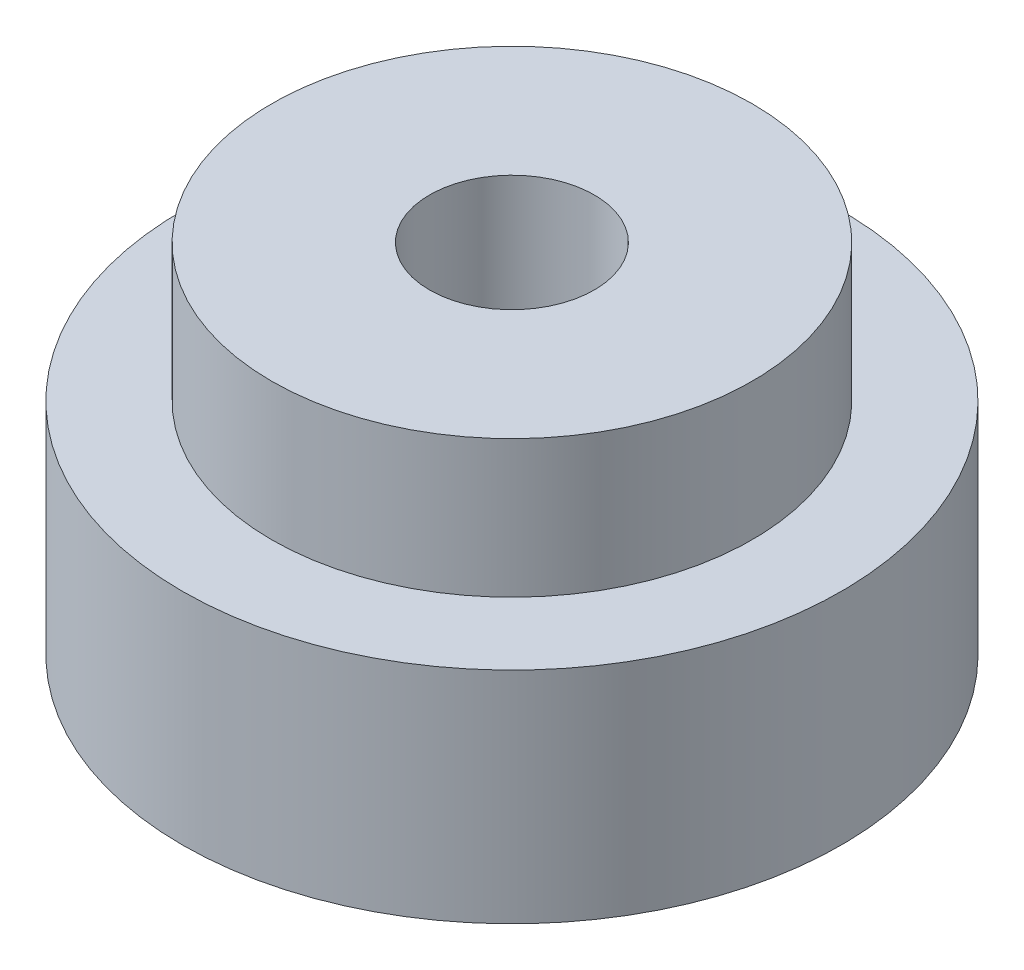
ISO-10303-21;
HEADER;
FILE_DESCRIPTION(('STEP AP214'),'2;1');
FILE_NAME('part.step','',(''),(''),'','','');
FILE_SCHEMA(('AUTOMOTIVE_DESIGN { 1 0 10303 214 1 1 1 1 }'));
ENDSEC;
DATA;
#1=APPLICATION_CONTEXT('core data for automotive mechanical design processes');
#2=APPLICATION_PROTOCOL_DEFINITION('international standard','automotive_design',2000,#1);
#3=PRODUCT_CONTEXT('',#1,'mechanical');
#4=PRODUCT('Part','Part','',(#3));
#5=PRODUCT_RELATED_PRODUCT_CATEGORY('part','',(#4));
#6=PRODUCT_DEFINITION_FORMATION('','',#4);
#7=PRODUCT_DEFINITION_CONTEXT('part definition',#1,'design');
#8=PRODUCT_DEFINITION('design','',#6,#7);
#9=PRODUCT_DEFINITION_SHAPE('','',#8);
#10=(LENGTH_UNIT() NAMED_UNIT(*) SI_UNIT(.MILLI.,.METRE.));
#11=(NAMED_UNIT(*) PLANE_ANGLE_UNIT() SI_UNIT($,.RADIAN.));
#12=(NAMED_UNIT(*) SI_UNIT($,.STERADIAN.) SOLID_ANGLE_UNIT());
#13=UNCERTAINTY_MEASURE_WITH_UNIT(LENGTH_MEASURE(1.E-05),#10,'distance_accuracy_value','');
#14=(GEOMETRIC_REPRESENTATION_CONTEXT(3) GLOBAL_UNCERTAINTY_ASSIGNED_CONTEXT((#13)) GLOBAL_UNIT_ASSIGNED_CONTEXT((#10,
#11,#12)) REPRESENTATION_CONTEXT('',''));
#15=CARTESIAN_POINT('',(0.,0.,0.));
#16=DIRECTION('',(0.,0.,1.));
#17=DIRECTION('',(1.,0.,0.));
#18=AXIS2_PLACEMENT_3D('',#15,#16,#17);
#19=CARTESIAN_POINT('',(0.,16.,0.));
#20=DIRECTION('',(0.,-1.,0.));
#21=DIRECTION('',(0.,0.,-1.));
#22=AXIS2_PLACEMENT_3D('',#19,#20,#21);
#23=CYLINDRICAL_SURFACE('',#22,24.);
#24=CARTESIAN_POINT('',(0.,16.,0.));
#25=DIRECTION('',(0.,1.,0.));
#26=DIRECTION('',(0.,0.,1.));
#27=AXIS2_PLACEMENT_3D('',#24,#25,#26);
#28=CIRCLE('',#27,24.);
#29=CARTESIAN_POINT('',(0.,16.,24.));
#30=VERTEX_POINT('',#29);
#31=EDGE_CURVE('E10',#30,#30,#28,.T.);
#32=ORIENTED_EDGE('',*,*,#31,.F.);
#33=EDGE_LOOP('',(#32));
#34=FACE_BOUND('',#33,.T.);
#35=CARTESIAN_POINT('',(0.,0.,0.));
#36=DIRECTION('',(0.,1.,0.));
#37=DIRECTION('',(0.,0.,1.));
#38=AXIS2_PLACEMENT_3D('',#35,#36,#37);
#39=CIRCLE('',#38,24.);
#40=CARTESIAN_POINT('',(0.,0.,24.));
#41=VERTEX_POINT('',#40);
#42=EDGE_CURVE('E34',#41,#41,#39,.T.);
#43=ORIENTED_EDGE('',*,*,#42,.T.);
#44=EDGE_LOOP('',(#43));
#45=FACE_BOUND('',#44,.T.);
#46=ADVANCED_FACE('F31',(#34,#45),#23,.T.);
#47=CARTESIAN_POINT('',(0.,16.,0.));
#48=DIRECTION('',(0.,1.,0.));
#49=DIRECTION('',(0.,0.,1.));
#50=AXIS2_PLACEMENT_3D('',#47,#48,#49);
#51=PLANE('',#50);
#52=CARTESIAN_POINT('',(0.,16.,0.));
#53=DIRECTION('',(0.,1.,0.));
#54=DIRECTION('',(0.,0.,1.));
#55=AXIS2_PLACEMENT_3D('',#52,#53,#54);
#56=CIRCLE('',#55,17.5);
#57=CARTESIAN_POINT('',(0.,16.,17.5));
#58=VERTEX_POINT('',#57);
#59=EDGE_CURVE('E43',#58,#58,#56,.T.);
#60=ORIENTED_EDGE('',*,*,#59,.F.);
#61=EDGE_LOOP('',(#60));
#62=FACE_BOUND('',#61,.T.);
#63=ORIENTED_EDGE('',*,*,#31,.T.);
#64=EDGE_LOOP('',(#63));
#65=FACE_BOUND('',#64,.T.);
#66=ADVANCED_FACE('F76',(#62,#65),#51,.T.);
#67=CARTESIAN_POINT('',(0.,0.,0.));
#68=DIRECTION('',(0.,1.,0.));
#69=DIRECTION('',(0.,0.,1.));
#70=AXIS2_PLACEMENT_3D('',#67,#68,#69);
#71=PLANE('',#70);
#72=CARTESIAN_POINT('',(0.,0.,0.));
#73=DIRECTION('',(0.,1.,0.));
#74=DIRECTION('',(0.,0.,1.));
#75=AXIS2_PLACEMENT_3D('',#72,#73,#74);
#76=CIRCLE('',#75,6.);
#77=CARTESIAN_POINT('',(0.,0.,6.));
#78=VERTEX_POINT('',#77);
#79=EDGE_CURVE('E46',#78,#78,#76,.T.);
#80=ORIENTED_EDGE('',*,*,#79,.T.);
#81=EDGE_LOOP('',(#80));
#82=FACE_BOUND('',#81,.T.);
#83=ORIENTED_EDGE('',*,*,#42,.F.);
#84=EDGE_LOOP('',(#83));
#85=FACE_BOUND('',#84,.T.);
#86=ADVANCED_FACE('F55',(#82,#85),#71,.F.);
#87=CARTESIAN_POINT('',(0.,26.,0.));
#88=DIRECTION('',(0.,-1.,0.));
#89=DIRECTION('',(0.,0.,-1.));
#90=AXIS2_PLACEMENT_3D('',#87,#88,#89);
#91=CYLINDRICAL_SURFACE('',#90,17.5);
#92=CARTESIAN_POINT('',(0.,26.,0.));
#93=DIRECTION('',(0.,1.,0.));
#94=DIRECTION('',(0.,0.,1.));
#95=AXIS2_PLACEMENT_3D('',#92,#93,#94);
#96=CIRCLE('',#95,17.5);
#97=CARTESIAN_POINT('',(0.,26.,17.5));
#98=VERTEX_POINT('',#97);
#99=EDGE_CURVE('E41',#98,#98,#96,.T.);
#100=ORIENTED_EDGE('',*,*,#99,.F.);
#101=EDGE_LOOP('',(#100));
#102=FACE_BOUND('',#101,.T.);
#103=ORIENTED_EDGE('',*,*,#59,.T.);
#104=EDGE_LOOP('',(#103));
#105=FACE_BOUND('',#104,.T.);
#106=ADVANCED_FACE('F67',(#102,#105),#91,.T.);
#107=CARTESIAN_POINT('',(0.,26.,0.));
#108=DIRECTION('',(0.,1.,0.));
#109=DIRECTION('',(0.,0.,1.));
#110=AXIS2_PLACEMENT_3D('',#107,#108,#109);
#111=PLANE('',#110);
#112=CARTESIAN_POINT('',(0.,26.,0.));
#113=DIRECTION('',(0.,1.,0.));
#114=DIRECTION('',(0.,0.,1.));
#115=AXIS2_PLACEMENT_3D('',#112,#113,#114);
#116=CIRCLE('',#115,6.);
#117=CARTESIAN_POINT('',(0.,26.,6.));
#118=VERTEX_POINT('',#117);
#119=EDGE_CURVE('E49',#118,#118,#116,.T.);
#120=ORIENTED_EDGE('',*,*,#119,.F.);
#121=EDGE_LOOP('',(#120));
#122=FACE_BOUND('',#121,.T.);
#123=ORIENTED_EDGE('',*,*,#99,.T.);
#124=EDGE_LOOP('',(#123));
#125=FACE_BOUND('',#124,.T.);
#126=ADVANCED_FACE('F61',(#122,#125),#111,.T.);
#127=CARTESIAN_POINT('',(0.,0.,0.));
#128=DIRECTION('',(0.,1.,0.));
#129=DIRECTION('',(0.,0.,1.));
#130=AXIS2_PLACEMENT_3D('',#127,#128,#129);
#131=CYLINDRICAL_SURFACE('',#130,6.);
#132=ORIENTED_EDGE('',*,*,#79,.F.);
#133=EDGE_LOOP('',(#132));
#134=FACE_BOUND('',#133,.T.);
#135=ORIENTED_EDGE('',*,*,#119,.T.);
#136=EDGE_LOOP('',(#135));
#137=FACE_BOUND('',#136,.T.);
#138=ADVANCED_FACE('F58',(#134,#137),#131,.F.);
#139=CLOSED_SHELL('',(#46,#66,#86,#106,#126,#138));
#140=MANIFOLD_SOLID_BREP('B2',#139);
#141=ADVANCED_BREP_SHAPE_REPRESENTATION('',(#18,#140),#14);
#142=SHAPE_DEFINITION_REPRESENTATION(#9,#141);
ENDSEC;
END-ISO-10303-21;
